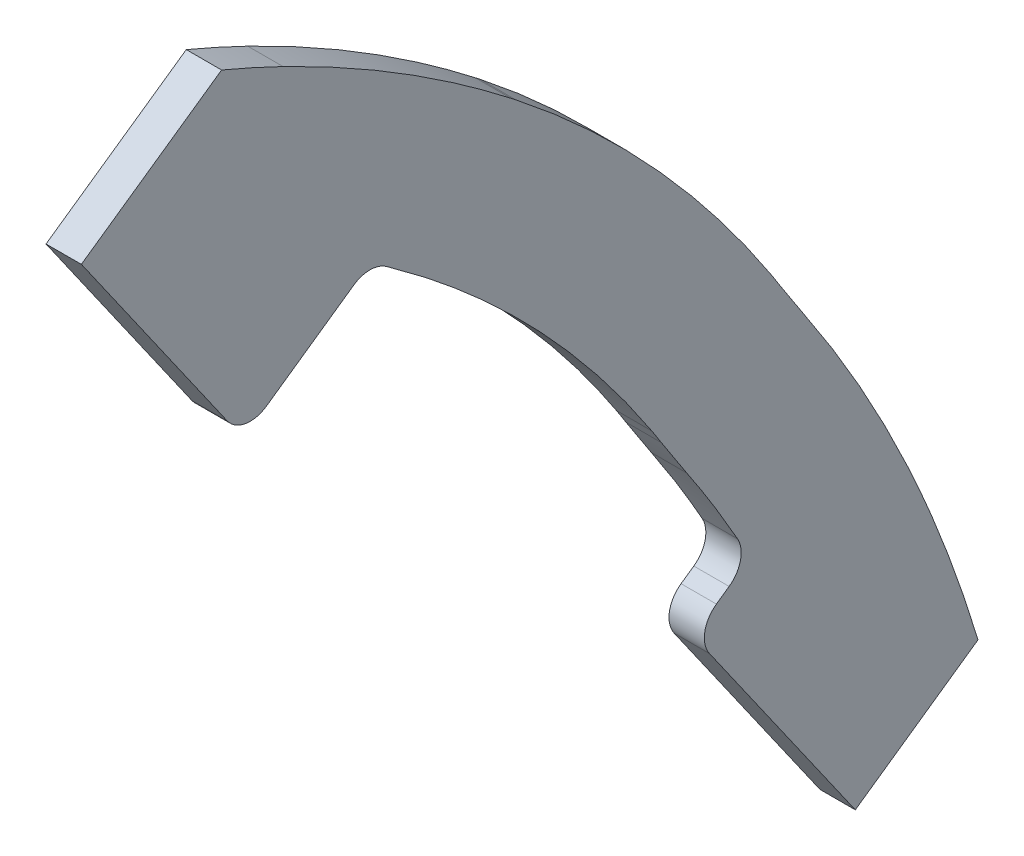
ISO-10303-21;
HEADER;
FILE_DESCRIPTION(('STEP AP214'),'2;1');
FILE_NAME('part.step','',(''),(''),'','','');
FILE_SCHEMA(('AUTOMOTIVE_DESIGN { 1 0 10303 214 1 1 1 1 }'));
ENDSEC;
DATA;
#1=APPLICATION_CONTEXT('core data for automotive mechanical design processes');
#2=APPLICATION_PROTOCOL_DEFINITION('international standard','automotive_design',2000,#1);
#3=PRODUCT_CONTEXT('',#1,'mechanical');
#4=PRODUCT('Part','Part','',(#3));
#5=PRODUCT_RELATED_PRODUCT_CATEGORY('part','',(#4));
#6=PRODUCT_DEFINITION_FORMATION('','',#4);
#7=PRODUCT_DEFINITION_CONTEXT('part definition',#1,'design');
#8=PRODUCT_DEFINITION('design','',#6,#7);
#9=PRODUCT_DEFINITION_SHAPE('','',#8);
#10=(LENGTH_UNIT() NAMED_UNIT(*) SI_UNIT(.MILLI.,.METRE.));
#11=(NAMED_UNIT(*) PLANE_ANGLE_UNIT() SI_UNIT($,.RADIAN.));
#12=(NAMED_UNIT(*) SI_UNIT($,.STERADIAN.) SOLID_ANGLE_UNIT());
#13=UNCERTAINTY_MEASURE_WITH_UNIT(LENGTH_MEASURE(1.E-05),#10,'distance_accuracy_value','');
#14=(GEOMETRIC_REPRESENTATION_CONTEXT(3) GLOBAL_UNCERTAINTY_ASSIGNED_CONTEXT((#13)) GLOBAL_UNIT_ASSIGNED_CONTEXT((#10,
#11,#12)) REPRESENTATION_CONTEXT('',''));
#15=CARTESIAN_POINT('',(0.,0.,0.));
#16=DIRECTION('',(0.,0.,1.));
#17=DIRECTION('',(1.,0.,0.));
#18=AXIS2_PLACEMENT_3D('',#15,#16,#17);
#19=CARTESIAN_POINT('',(-1.5875,88.7800683087997,-96.776788330437));
#20=CARTESIAN_POINT('',(-1.5875,95.4836120909318,-94.0088629009082));
#21=CARTESIAN_POINT('',(-1.5875,101.901927907169,-90.5708956129696));
#22=CARTESIAN_POINT('',(-1.5875,107.915935135417,-86.5173656866349));
#23=B_SPLINE_CURVE_WITH_KNOTS('',3,(#19,#20,#21,#22),.UNSPECIFIED.,.F.,.F.,(4,4),(0.,1.),.UNSPECIFIED.);
#24=DIRECTION('',(1.,0.,0.));
#25=VECTOR('',#24,1.);
#26=SURFACE_OF_LINEAR_EXTRUSION('',#23,#25);
#27=CARTESIAN_POINT('',(-1.5875,107.915935135417,-86.5173656866349));
#28=CARTESIAN_POINT('',(-1.5875,105.504266930419,-88.1428657684157));
#29=CARTESIAN_POINT('',(-1.5875,103.027582733859,-89.6693785506604));
#30=CARTESIAN_POINT('',(-1.5875,100.493561497346,-91.0933909236212));
#31=B_SPLINE_CURVE_WITH_KNOTS('',3,(#27,#28,#29,#30),.UNSPECIFIED.,.F.,.F.,(4,4),
(0.598991468837967,1.),.UNSPECIFIED.);
#32=CARTESIAN_POINT('',(-1.5875,100.493573316672,-91.0934119560397));
#33=VERTEX_POINT('',#32);
#34=CARTESIAN_POINT('',(-1.5875,107.915935135417,-86.5173656866349));
#35=VERTEX_POINT('',#34);
#36=EDGE_CURVE('E383',#33,#35,#31,.F.);
#37=ORIENTED_EDGE('',*,*,#36,.F.);
#38=DIRECTION('',(1.,0.,0.));
#39=VECTOR('',#38,1.);
#40=CARTESIAN_POINT('',(-1.5875,100.49356149863,-91.0933909228994));
#41=LINE('',#40,#39);
#42=CARTESIAN_POINT('',(1.5875,100.493573316672,-91.0934119560397));
#43=VERTEX_POINT('',#42);
#44=EDGE_CURVE('E63',#33,#43,#41,.T.);
#45=ORIENTED_EDGE('',*,*,#44,.T.);
#46=CARTESIAN_POINT('',(1.5875,100.493561497988,-91.0933909232603));
#47=CARTESIAN_POINT('',(1.5875,103.027582734277,-89.6693785504025));
#48=CARTESIAN_POINT('',(1.5875,105.504266930623,-88.1428657682784));
#49=CARTESIAN_POINT('',(1.5875,107.915935135417,-86.5173656866349));
#50=B_SPLINE_CURVE_WITH_KNOTS('',3,(#46,#47,#48,#49),.UNSPECIFIED.,.F.,.F.,(4,4),
(0.59899146887184,1.),.UNSPECIFIED.);
#51=CARTESIAN_POINT('',(1.5875,107.915935135417,-86.5173656866349));
#52=VERTEX_POINT('',#51);
#53=EDGE_CURVE('E285',#43,#52,#50,.T.);
#54=ORIENTED_EDGE('',*,*,#53,.T.);
#55=DIRECTION('',(1.,0.,0.));
#56=VECTOR('',#55,1.);
#57=CARTESIAN_POINT('',(-1.5875,107.915935135417,-86.5173656866349));
#58=LINE('',#57,#56);
#59=EDGE_CURVE('E566',#35,#52,#58,.T.);
#60=ORIENTED_EDGE('',*,*,#59,.F.);
#61=EDGE_LOOP('',(#37,#45,#54,#60));
#62=FACE_BOUND('',#61,.T.);
#63=ADVANCED_FACE('F41',(#62),#26,.F.);
#64=CARTESIAN_POINT('',(1.5875,93.6270317100952,-108.515482712118));
#65=CARTESIAN_POINT('',(1.5875,88.0312485824802,-110.826008494565));
#66=CARTESIAN_POINT('',(1.5875,82.2656921555576,-112.729048559774));
#67=CARTESIAN_POINT('',(1.5875,76.3893372673394,-114.202129114204));
#68=(BOUNDED_CURVE() B_SPLINE_CURVE(3,(#64,#65,#66,#67),.UNSPECIFIED.,.F.,
.F.) B_SPLINE_CURVE_WITH_KNOTS((4,4),(0.,1.),
.UNSPECIFIED.) CURVE() GEOMETRIC_REPRESENTATION_ITEM() RATIONAL_B_SPLINE_CURVE((1.,1.,1.,1.)) REPRESENTATION_ITEM(''));
#69=DIRECTION('',(-1.,0.,0.));
#70=VECTOR('',#69,1.);
#71=SURFACE_OF_LINEAR_EXTRUSION('',#68,#70);
#72=CARTESIAN_POINT('',(1.5875,93.6270317100952,-108.515482712118));
#73=VERTEX_POINT('',#72);
#74=CARTESIAN_POINT('',(1.5875,81.825546879037,-112.707408993809));
#75=VERTEX_POINT('',#74);
#76=EDGE_CURVE('E223',#73,#75,#68,.T.);
#77=ORIENTED_EDGE('',*,*,#76,.T.);
#78=DIRECTION('',(1.,0.,0.));
#79=VECTOR('',#78,1.);
#80=CARTESIAN_POINT('',(-2.2225,81.825546879037,-112.707408993809));
#81=LINE('',#80,#79);
#82=CARTESIAN_POINT('',(-1.5875,81.825546879037,-112.707408993809));
#83=VERTEX_POINT('',#82);
#84=EDGE_CURVE('E206',#83,#75,#81,.T.);
#85=ORIENTED_EDGE('',*,*,#84,.F.);
#86=CARTESIAN_POINT('',(-1.5875,93.6270317100952,-108.515482712118));
#87=CARTESIAN_POINT('',(-1.5875,88.0312485824802,-110.826008494565));
#88=CARTESIAN_POINT('',(-1.5875,82.2656921555576,-112.729048559774));
#89=CARTESIAN_POINT('',(-1.5875,76.3893372673394,-114.202129114204));
#90=(BOUNDED_CURVE() B_SPLINE_CURVE(3,(#86,#87,#88,#89),.UNSPECIFIED.,.F.,
.F.) B_SPLINE_CURVE_WITH_KNOTS((4,4),(0.,1.),
.UNSPECIFIED.) CURVE() GEOMETRIC_REPRESENTATION_ITEM() RATIONAL_B_SPLINE_CURVE((1.,1.,1.,1.)) REPRESENTATION_ITEM(''));
#91=CARTESIAN_POINT('',(-1.5875,93.6270317100952,-108.515482712118));
#92=VERTEX_POINT('',#91);
#93=EDGE_CURVE('E774',#92,#83,#90,.T.);
#94=ORIENTED_EDGE('',*,*,#93,.F.);
#95=DIRECTION('',(-1.,0.,0.));
#96=VECTOR('',#95,1.);
#97=CARTESIAN_POINT('',(1.5875,93.6270317100952,-108.515482712118));
#98=LINE('',#97,#96);
#99=EDGE_CURVE('E392',#73,#92,#98,.T.);
#100=ORIENTED_EDGE('',*,*,#99,.F.);
#101=EDGE_LOOP('',(#77,#85,#94,#100));
#102=FACE_BOUND('',#101,.T.);
#103=ADVANCED_FACE('F309',(#102),#71,.T.);
#104=CARTESIAN_POINT('',(1.5875,169.18994581688,8.75182569076107E-09));
#105=CARTESIAN_POINT('',(1.5875,169.189794661323,-13.0067356295379));
#106=CARTESIAN_POINT('',(1.5875,167.235783234296,-26.0150387116111));
#107=CARTESIAN_POINT('',(1.5875,163.333674627763,-38.5625912605726));
#108=CARTESIAN_POINT('',(1.5875,157.690613368795,-50.2374657150393));
#109=(BOUNDED_CURVE() B_SPLINE_CURVE(4,(#104,#105,#106,#107,#108),.UNSPECIFIED.,.F.,
.F.) B_SPLINE_CURVE_WITH_KNOTS((5,5),(0.,1.),
.UNSPECIFIED.) CURVE() GEOMETRIC_REPRESENTATION_ITEM() RATIONAL_B_SPLINE_CURVE((1.,1.,1.,1.,1.)) REPRESENTATION_ITEM(''));
#110=DIRECTION('',(-1.,0.,0.));
#111=VECTOR('',#110,1.);
#112=SURFACE_OF_LINEAR_EXTRUSION('',#109,#111);
#113=DIRECTION('',(1.,0.,0.));
#114=VECTOR('',#113,1.);
#115=CARTESIAN_POINT('',(-2.2225,160.183857740543,-44.7127582391958));
#116=LINE('',#115,#114);
#117=CARTESIAN_POINT('',(-1.5875,160.183857740543,-44.7127582391958));
#118=VERTEX_POINT('',#117);
#119=CARTESIAN_POINT('',(1.5875,160.183857740543,-44.7127582391958));
#120=VERTEX_POINT('',#119);
#121=EDGE_CURVE('E222',#118,#120,#116,.T.);
#122=ORIENTED_EDGE('',*,*,#121,.T.);
#123=CARTESIAN_POINT('',(1.5875,157.690613368795,-50.2374657150393));
#124=VERTEX_POINT('',#123);
#125=EDGE_CURVE('E352',#120,#124,#109,.T.);
#126=ORIENTED_EDGE('',*,*,#125,.T.);
#127=DIRECTION('',(-1.,0.,0.));
#128=VECTOR('',#127,1.);
#129=CARTESIAN_POINT('',(1.5875,157.690613368795,-50.2374657150393));
#130=LINE('',#129,#128);
#131=CARTESIAN_POINT('',(-1.5875,157.690613368795,-50.2374657150393));
#132=VERTEX_POINT('',#131);
#133=EDGE_CURVE('E741',#124,#132,#130,.T.);
#134=ORIENTED_EDGE('',*,*,#133,.T.);
#135=CARTESIAN_POINT('',(-1.5875,169.18994581688,8.75182569076107E-09));
#136=CARTESIAN_POINT('',(-1.5875,169.189794661323,-13.0067356295379));
#137=CARTESIAN_POINT('',(-1.5875,167.235783234296,-26.0150387116111));
#138=CARTESIAN_POINT('',(-1.5875,163.333674627763,-38.5625912605726));
#139=CARTESIAN_POINT('',(-1.5875,157.690613368795,-50.2374657150393));
#140=(BOUNDED_CURVE() B_SPLINE_CURVE(4,(#135,#136,#137,#138,#139),.UNSPECIFIED.,.F.,
.F.) B_SPLINE_CURVE_WITH_KNOTS((5,5),(0.,1.),
.UNSPECIFIED.) CURVE() GEOMETRIC_REPRESENTATION_ITEM() RATIONAL_B_SPLINE_CURVE((1.,1.,1.,1.,1.)) REPRESENTATION_ITEM(''));
#141=EDGE_CURVE('E733',#118,#132,#140,.T.);
#142=ORIENTED_EDGE('',*,*,#141,.F.);
#143=EDGE_LOOP('',(#122,#126,#134,#142));
#144=FACE_BOUND('',#143,.T.);
#145=ADVANCED_FACE('F668',(#144),#112,.T.);
#146=CARTESIAN_POINT('',(1.5875,115.014111075737,-97.0485526244998));
#147=CARTESIAN_POINT('',(1.5875,108.292402496115,-101.579083741193));
#148=CARTESIAN_POINT('',(1.5875,101.116024349716,-105.423241676263));
#149=CARTESIAN_POINT('',(1.5875,93.627031710095,-108.515482712118));
#150=(BOUNDED_CURVE() B_SPLINE_CURVE(3,(#146,#147,#148,#149),.UNSPECIFIED.,.F.,
.F.) B_SPLINE_CURVE_WITH_KNOTS((4,4),(0.,1.),
.UNSPECIFIED.) CURVE() GEOMETRIC_REPRESENTATION_ITEM() RATIONAL_B_SPLINE_CURVE((1.,1.,1.,1.)) REPRESENTATION_ITEM(''));
#151=DIRECTION('',(-1.,0.,0.));
#152=VECTOR('',#151,1.);
#153=SURFACE_OF_LINEAR_EXTRUSION('',#150,#152);
#154=CARTESIAN_POINT('',(-1.5875,115.014111075737,-97.0485526244998));
#155=CARTESIAN_POINT('',(-1.5875,108.292402496115,-101.579083741193));
#156=CARTESIAN_POINT('',(-1.5875,101.116024349716,-105.423241676263));
#157=CARTESIAN_POINT('',(-1.5875,93.627031710095,-108.515482712118));
#158=(BOUNDED_CURVE() B_SPLINE_CURVE(3,(#154,#155,#156,#157),.UNSPECIFIED.,.F.,
.F.) B_SPLINE_CURVE_WITH_KNOTS((4,4),(0.,1.),
.UNSPECIFIED.) CURVE() GEOMETRIC_REPRESENTATION_ITEM() RATIONAL_B_SPLINE_CURVE((1.,1.,1.,1.)) REPRESENTATION_ITEM(''));
#159=CARTESIAN_POINT('',(-1.5875,115.014111075737,-97.0485526244998));
#160=VERTEX_POINT('',#159);
#161=EDGE_CURVE('E766',#160,#92,#158,.T.);
#162=ORIENTED_EDGE('',*,*,#161,.F.);
#163=DIRECTION('',(-1.,0.,0.));
#164=VECTOR('',#163,1.);
#165=CARTESIAN_POINT('',(1.5875,115.014111075737,-97.0485526244998));
#166=LINE('',#165,#164);
#167=CARTESIAN_POINT('',(1.5875,115.014111075737,-97.0485526244998));
#168=VERTEX_POINT('',#167);
#169=EDGE_CURVE('E687',#168,#160,#166,.T.);
#170=ORIENTED_EDGE('',*,*,#169,.F.);
#171=EDGE_CURVE('E651',#168,#73,#150,.T.);
#172=ORIENTED_EDGE('',*,*,#171,.T.);
#173=ORIENTED_EDGE('',*,*,#99,.T.);
#174=EDGE_LOOP('',(#162,#170,#172,#173));
#175=FACE_BOUND('',#174,.T.);
#176=ADVANCED_FACE('F671',(#175),#153,.T.);
#177=CARTESIAN_POINT('',(1.5875,118.178380489188,-94.9883093202764));
#178=CARTESIAN_POINT('',(1.5875,117.116005214424,-95.6560781713369));
#179=CARTESIAN_POINT('',(1.5875,116.060431913397,-96.3433169268644));
#180=CARTESIAN_POINT('',(1.5875,115.014111075737,-97.0485526244998));
#181=(BOUNDED_CURVE() B_SPLINE_CURVE(3,(#177,#178,#179,#180),.UNSPECIFIED.,.F.,
.F.) B_SPLINE_CURVE_WITH_KNOTS((4,4),(0.,1.),
.UNSPECIFIED.) CURVE() GEOMETRIC_REPRESENTATION_ITEM() RATIONAL_B_SPLINE_CURVE((1.,1.,1.,1.)) REPRESENTATION_ITEM(''));
#182=DIRECTION('',(-1.,0.,0.));
#183=VECTOR('',#182,1.);
#184=SURFACE_OF_LINEAR_EXTRUSION('',#181,#183);
#185=CARTESIAN_POINT('',(-1.5875,118.178380489188,-94.9883093202764));
#186=CARTESIAN_POINT('',(-1.5875,117.116005214424,-95.6560781713369));
#187=CARTESIAN_POINT('',(-1.5875,116.060431913397,-96.3433169268644));
#188=CARTESIAN_POINT('',(-1.5875,115.014111075737,-97.0485526244998));
#189=(BOUNDED_CURVE() B_SPLINE_CURVE(3,(#185,#186,#187,#188),.UNSPECIFIED.,.F.,
.F.) B_SPLINE_CURVE_WITH_KNOTS((4,4),(0.,1.),
.UNSPECIFIED.) CURVE() GEOMETRIC_REPRESENTATION_ITEM() RATIONAL_B_SPLINE_CURVE((1.,1.,1.,1.)) REPRESENTATION_ITEM(''));
#190=CARTESIAN_POINT('',(-1.5875,118.178380489188,-94.9883093202763));
#191=VERTEX_POINT('',#190);
#192=EDGE_CURVE('E761',#191,#160,#189,.T.);
#193=ORIENTED_EDGE('',*,*,#192,.F.);
#194=DIRECTION('',(-1.,0.,0.));
#195=VECTOR('',#194,1.);
#196=CARTESIAN_POINT('',(1.5875,118.178380489188,-94.9883093202763));
#197=LINE('',#196,#195);
#198=CARTESIAN_POINT('',(1.5875,118.178380489188,-94.9883093202763));
#199=VERTEX_POINT('',#198);
#200=EDGE_CURVE('E694',#199,#191,#197,.T.);
#201=ORIENTED_EDGE('',*,*,#200,.F.);
#202=EDGE_CURVE('E681',#199,#168,#181,.T.);
#203=ORIENTED_EDGE('',*,*,#202,.T.);
#204=ORIENTED_EDGE('',*,*,#169,.T.);
#205=EDGE_LOOP('',(#193,#201,#203,#204));
#206=FACE_BOUND('',#205,.T.);
#207=ADVANCED_FACE('F674',(#206),#184,.T.);
#208=CARTESIAN_POINT('',(1.5875,63.3548181596361,-7.75744346018917));
#209=DIRECTION('',(-1.,0.,0.));
#210=DIRECTION('',(0.,0.,1.));
#211=AXIS2_PLACEMENT_3D('',#208,#209,#210);
#212=CYLINDRICAL_SURFACE('',#211,103.0283793195);
#213=CARTESIAN_POINT('',(-1.5875,63.3548181596361,-7.75744346018917));
#214=DIRECTION('',(1.,0.,0.));
#215=DIRECTION('',(0.,0.,-1.));
#216=AXIS2_PLACEMENT_3D('',#213,#214,#215);
#217=CIRCLE('',#216,103.0283793195);
#218=CARTESIAN_POINT('',(-1.5875,119.697960171294,-94.0146013861083));
#219=VERTEX_POINT('',#218);
#220=EDGE_CURVE('E755',#219,#191,#217,.F.);
#221=ORIENTED_EDGE('',*,*,#220,.F.);
#222=DIRECTION('',(-1.,0.,0.));
#223=VECTOR('',#222,1.);
#224=CARTESIAN_POINT('',(1.5875,119.697960171294,-94.0146013861083));
#225=LINE('',#224,#223);
#226=CARTESIAN_POINT('',(1.5875,119.697960171294,-94.0146013861083));
#227=VERTEX_POINT('',#226);
#228=EDGE_CURVE('E701',#227,#219,#225,.T.);
#229=ORIENTED_EDGE('',*,*,#228,.F.);
#230=CARTESIAN_POINT('',(1.5875,63.3548181596361,-7.75744346018917));
#231=DIRECTION('',(1.,0.,0.));
#232=DIRECTION('',(0.,0.,-1.));
#233=AXIS2_PLACEMENT_3D('',#230,#231,#232);
#234=CIRCLE('',#233,103.0283793195);
#235=EDGE_CURVE('E688',#227,#199,#234,.F.);
#236=ORIENTED_EDGE('',*,*,#235,.T.);
#237=ORIENTED_EDGE('',*,*,#200,.T.);
#238=EDGE_LOOP('',(#221,#229,#236,#237));
#239=FACE_BOUND('',#238,.T.);
#240=ADVANCED_FACE('F678',(#239),#212,.T.);
#241=CARTESIAN_POINT('',(1.5875,144.635475433697,-71.1611432299567));
#242=CARTESIAN_POINT('',(1.5875,137.608784490994,-80.1065976384552));
#243=CARTESIAN_POINT('',(1.5875,129.14774479477,-87.841288267326));
#244=CARTESIAN_POINT('',(1.5875,119.697960171294,-94.0146013861083));
#245=(BOUNDED_CURVE() B_SPLINE_CURVE(3,(#241,#242,#243,#244),.UNSPECIFIED.,.F.,
.F.) B_SPLINE_CURVE_WITH_KNOTS((4,4),(0.,1.),
.UNSPECIFIED.) CURVE() GEOMETRIC_REPRESENTATION_ITEM() RATIONAL_B_SPLINE_CURVE((1.,1.,1.,1.)) REPRESENTATION_ITEM(''));
#246=DIRECTION('',(-1.,0.,0.));
#247=VECTOR('',#246,1.);
#248=SURFACE_OF_LINEAR_EXTRUSION('',#245,#247);
#249=CARTESIAN_POINT('',(-1.5875,144.635475433697,-71.1611432299567));
#250=CARTESIAN_POINT('',(-1.5875,137.608784490994,-80.1065976384552));
#251=CARTESIAN_POINT('',(-1.5875,129.14774479477,-87.841288267326));
#252=CARTESIAN_POINT('',(-1.5875,119.697960171294,-94.0146013861083));
#253=(BOUNDED_CURVE() B_SPLINE_CURVE(3,(#249,#250,#251,#252),.UNSPECIFIED.,.F.,
.F.) B_SPLINE_CURVE_WITH_KNOTS((4,4),(0.,1.),
.UNSPECIFIED.) CURVE() GEOMETRIC_REPRESENTATION_ITEM() RATIONAL_B_SPLINE_CURVE((1.,1.,1.,1.)) REPRESENTATION_ITEM(''));
#254=CARTESIAN_POINT('',(-1.5875,144.635475433697,-71.1611432299567));
#255=VERTEX_POINT('',#254);
#256=EDGE_CURVE('E728',#255,#219,#253,.T.);
#257=ORIENTED_EDGE('',*,*,#256,.F.);
#258=DIRECTION('',(-1.,0.,0.));
#259=VECTOR('',#258,1.);
#260=CARTESIAN_POINT('',(1.5875,144.635475433697,-71.1611432299567));
#261=LINE('',#260,#259);
#262=CARTESIAN_POINT('',(1.5875,144.635475433697,-71.1611432299567));
#263=VERTEX_POINT('',#262);
#264=EDGE_CURVE('E725',#263,#255,#261,.T.);
#265=ORIENTED_EDGE('',*,*,#264,.F.);
#266=EDGE_CURVE('E695',#263,#227,#245,.T.);
#267=ORIENTED_EDGE('',*,*,#266,.T.);
#268=ORIENTED_EDGE('',*,*,#228,.T.);
#269=EDGE_LOOP('',(#257,#265,#267,#268));
#270=FACE_BOUND('',#269,.T.);
#271=ADVANCED_FACE('F709',(#270),#248,.T.);
#272=CARTESIAN_POINT('',(1.5875,144.994599704752,-70.7017822344691));
#273=CARTESIAN_POINT('',(1.5875,144.875309775761,-70.8552412666994));
#274=CARTESIAN_POINT('',(1.5875,144.755529232783,-71.0083060491197));
#275=CARTESIAN_POINT('',(1.5875,144.635475433697,-71.1611432299567));
#276=(BOUNDED_CURVE() B_SPLINE_CURVE(3,(#272,#273,#274,#275),.UNSPECIFIED.,.F.,
.F.) B_SPLINE_CURVE_WITH_KNOTS((4,4),(0.,1.),
.UNSPECIFIED.) CURVE() GEOMETRIC_REPRESENTATION_ITEM() RATIONAL_B_SPLINE_CURVE((1.,1.,1.,1.)) REPRESENTATION_ITEM(''));
#277=DIRECTION('',(-1.,0.,0.));
#278=VECTOR('',#277,1.);
#279=SURFACE_OF_LINEAR_EXTRUSION('',#276,#278);
#280=CARTESIAN_POINT('',(-1.5875,144.994599704752,-70.7017822344691));
#281=CARTESIAN_POINT('',(-1.5875,144.875309775761,-70.8552412666994));
#282=CARTESIAN_POINT('',(-1.5875,144.755529232783,-71.0083060491197));
#283=CARTESIAN_POINT('',(-1.5875,144.635475433697,-71.1611432299567));
#284=(BOUNDED_CURVE() B_SPLINE_CURVE(3,(#280,#281,#282,#283),.UNSPECIFIED.,.F.,
.F.) B_SPLINE_CURVE_WITH_KNOTS((4,4),(0.,1.),
.UNSPECIFIED.) CURVE() GEOMETRIC_REPRESENTATION_ITEM() RATIONAL_B_SPLINE_CURVE((1.,1.,1.,1.)) REPRESENTATION_ITEM(''));
#285=CARTESIAN_POINT('',(-1.5875,144.994599704752,-70.7017822344691));
#286=VERTEX_POINT('',#285);
#287=EDGE_CURVE('E721',#286,#255,#284,.T.);
#288=ORIENTED_EDGE('',*,*,#287,.F.);
#289=DIRECTION('',(-1.,0.,0.));
#290=VECTOR('',#289,1.);
#291=CARTESIAN_POINT('',(1.5875,144.994599704752,-70.7017822344691));
#292=LINE('',#291,#290);
#293=CARTESIAN_POINT('',(1.5875,144.994599704752,-70.7017822344691));
#294=VERTEX_POINT('',#293);
#295=EDGE_CURVE('E212',#294,#286,#292,.T.);
#296=ORIENTED_EDGE('',*,*,#295,.F.);
#297=EDGE_CURVE('E702',#294,#263,#276,.T.);
#298=ORIENTED_EDGE('',*,*,#297,.T.);
#299=ORIENTED_EDGE('',*,*,#264,.T.);
#300=EDGE_LOOP('',(#288,#296,#298,#299));
#301=FACE_BOUND('',#300,.T.);
#302=ADVANCED_FACE('F711',(#301),#279,.T.);
#303=CARTESIAN_POINT('',(1.5875,157.690613368795,-50.2374657150393));
#304=CARTESIAN_POINT('',(1.5875,154.185304199465,-57.4895836956331));
#305=CARTESIAN_POINT('',(1.5875,149.921691806846,-64.3634008386052));
#306=CARTESIAN_POINT('',(1.5875,144.994599704752,-70.7017822344691));
#307=(BOUNDED_CURVE() B_SPLINE_CURVE(3,(#303,#304,#305,#306),.UNSPECIFIED.,.F.,
.F.) B_SPLINE_CURVE_WITH_KNOTS((4,4),(0.,1.),
.UNSPECIFIED.) CURVE() GEOMETRIC_REPRESENTATION_ITEM() RATIONAL_B_SPLINE_CURVE((1.,1.,1.,1.)) REPRESENTATION_ITEM(''));
#308=DIRECTION('',(-1.,0.,0.));
#309=VECTOR('',#308,1.);
#310=SURFACE_OF_LINEAR_EXTRUSION('',#307,#309);
#311=CARTESIAN_POINT('',(-1.5875,157.690613368795,-50.2374657150393));
#312=CARTESIAN_POINT('',(-1.5875,154.185304199465,-57.4895836956331));
#313=CARTESIAN_POINT('',(-1.5875,149.921691806846,-64.3634008386052));
#314=CARTESIAN_POINT('',(-1.5875,144.994599704752,-70.7017822344691));
#315=(BOUNDED_CURVE() B_SPLINE_CURVE(3,(#311,#312,#313,#314),.UNSPECIFIED.,.F.,
.F.) B_SPLINE_CURVE_WITH_KNOTS((4,4),(0.,1.),
.UNSPECIFIED.) CURVE() GEOMETRIC_REPRESENTATION_ITEM() RATIONAL_B_SPLINE_CURVE((1.,1.,1.,1.)) REPRESENTATION_ITEM(''));
#316=EDGE_CURVE('E729',#132,#286,#315,.T.);
#317=ORIENTED_EDGE('',*,*,#316,.F.);
#318=ORIENTED_EDGE('',*,*,#133,.F.);
#319=EDGE_CURVE('E785',#124,#294,#307,.T.);
#320=ORIENTED_EDGE('',*,*,#319,.T.);
#321=ORIENTED_EDGE('',*,*,#295,.T.);
#322=EDGE_LOOP('',(#317,#318,#320,#321));
#323=FACE_BOUND('',#322,.T.);
#324=ADVANCED_FACE('F402',(#323),#310,.T.);
#325=CARTESIAN_POINT('',(1.5875,0.,0.));
#326=DIRECTION('',(1.,0.,0.));
#327=DIRECTION('',(0.,0.,-1.));
#328=AXIS2_PLACEMENT_3D('',#325,#326,#327);
#329=PLANE('',#328);
#330=DIRECTION('',(0.,0.573576436351042,-0.819152044288995));
#331=VECTOR('',#330,1.);
#332=CARTESIAN_POINT('',(1.5875,22.7570677304037,15.9346703723774));
#333=LINE('',#332,#331);
#334=CARTESIAN_POINT('',(1.5875,96.3667462815078,-89.190845327311));
#335=VERTEX_POINT('',#334);
#336=CARTESIAN_POINT('',(1.5875,97.1685643085926,-90.3359601444621));
#337=VERTEX_POINT('',#336);
#338=EDGE_CURVE('E228',#335,#337,#333,.T.);
#339=ORIENTED_EDGE('',*,*,#338,.F.);
#340=CARTESIAN_POINT('',(1.5875,94.2861000890138,-90.6477294756426));
#341=DIRECTION('',(1.,0.,0.));
#342=DIRECTION('',(0.,0.,-1.));
#343=AXIS2_PLACEMENT_3D('',#340,#341,#342);
#344=CIRCLE('',#343,2.54);
#345=CARTESIAN_POINT('',(1.5875,92.8292159406821,-88.5670832831486));
#346=VERTEX_POINT('',#345);
#347=EDGE_CURVE('E227',#335,#346,#344,.T.);
#348=ORIENTED_EDGE('',*,*,#347,.T.);
#349=DIRECTION('',(0.,0.819152044288995,0.573576436351041));
#350=VECTOR('',#349,1.);
#351=CARTESIAN_POINT('',(1.5875,72.1527944027725,-103.044869507194));
#352=LINE('',#351,#350);
#353=CARTESIAN_POINT('',(1.5875,74.1034002082357,-101.679040618133));
#354=VERTEX_POINT('',#353);
#355=EDGE_CURVE('E218',#354,#346,#352,.T.);
#356=ORIENTED_EDGE('',*,*,#355,.F.);
#357=DIRECTION('',(0.,0.573576436351042,-0.819152044288995));
#358=VECTOR('',#357,1.);
#359=CARTESIAN_POINT('',(1.5875,1.95060580546317,1.36582888906092));
#360=LINE('',#359,#358);
#361=EDGE_CURVE('E200',#354,#75,#360,.T.);
#362=ORIENTED_EDGE('',*,*,#361,.T.);
#363=ORIENTED_EDGE('',*,*,#76,.F.);
#364=ORIENTED_EDGE('',*,*,#171,.F.);
#365=ORIENTED_EDGE('',*,*,#202,.F.);
#366=ORIENTED_EDGE('',*,*,#235,.F.);
#367=ORIENTED_EDGE('',*,*,#266,.F.);
#368=ORIENTED_EDGE('',*,*,#297,.F.);
#369=ORIENTED_EDGE('',*,*,#319,.F.);
#370=ORIENTED_EDGE('',*,*,#125,.F.);
#371=DIRECTION('',(0.,0.573576436351042,-0.819152044288995));
#372=VECTOR('',#371,1.);
#373=CARTESIAN_POINT('',(1.5875,86.4768573755338,60.551747415034));
#374=LINE('',#373,#372);
#375=CARTESIAN_POINT('',(1.5875,151.359113870986,-32.109744919961));
#376=VERTEX_POINT('',#375);
#377=EDGE_CURVE('E339',#376,#120,#374,.T.);
#378=ORIENTED_EDGE('',*,*,#377,.F.);
#379=DIRECTION('',(0.,-0.819152044288995,-0.573576436351042));
#380=VECTOR('',#379,1.);
#381=CARTESIAN_POINT('',(1.5875,64.8737972727763,-92.6493842649085));
#382=LINE('',#381,#380);
#383=CARTESIAN_POINT('',(1.5875,132.624838915863,-45.2095941848599));
#384=VERTEX_POINT('',#383);
#385=EDGE_CURVE('E252',#376,#384,#382,.T.);
#386=ORIENTED_EDGE('',*,*,#385,.T.);
#387=CARTESIAN_POINT('',(1.5875,134.081723064194,-47.290240377354));
#388=DIRECTION('',(1.,0.,0.));
#389=DIRECTION('',(0.,0.,-1.));
#390=AXIS2_PLACEMENT_3D('',#387,#388,#389);
#391=CIRCLE('',#390,2.54);
#392=CARTESIAN_POINT('',(1.5875,132.0010768717,-48.7471245256856));
#393=VERTEX_POINT('',#392);
#394=EDGE_CURVE('E360',#384,#393,#391,.T.);
#395=ORIENTED_EDGE('',*,*,#394,.T.);
#396=DIRECTION('',(0.,0.573576436351042,-0.819152044288995));
#397=VECTOR('',#396,1.);
#398=CARTESIAN_POINT('',(1.5875,65.6703954505924,45.9829059317169));
#399=LINE('',#398,#397);
#400=CARTESIAN_POINT('',(1.5875,137.496605686943,-56.5955530491685));
#401=VERTEX_POINT('',#400);
#402=EDGE_CURVE('E355',#393,#401,#399,.T.);
#403=ORIENTED_EDGE('',*,*,#402,.T.);
#404=CARTESIAN_POINT('',(1.5875,135.415959494449,-58.0524371975002));
#405=DIRECTION('',(1.,0.,0.));
#406=DIRECTION('',(0.,0.,-1.));
#407=AXIS2_PLACEMENT_3D('',#404,#405,#406);
#408=CIRCLE('',#407,2.54);
#409=CARTESIAN_POINT('',(1.5875,137.484615318078,-59.5263862965671));
#410=VERTEX_POINT('',#409);
#411=EDGE_CURVE('E273',#401,#410,#408,.F.);
#412=ORIENTED_EDGE('',*,*,#411,.T.);
#413=CARTESIAN_POINT('',(1.5875,134.967710945653,-62.9074572596774));
#414=CARTESIAN_POINT('',(1.5875,135.830235138975,-61.7978763573623));
#415=CARTESIAN_POINT('',(1.5875,136.669349898596,-60.6705045895705));
#416=CARTESIAN_POINT('',(1.5875,137.484573177318,-59.5263562695828));
#417=B_SPLINE_CURVE_WITH_KNOTS('',3,(#413,#414,#415,#416),.UNSPECIFIED.,.F.,.F.,(4,4),(0.,
0.196444717254091),.UNSPECIFIED.);
#418=CARTESIAN_POINT('',(1.5875,134.967710945647,-62.9074572596726));
#419=VERTEX_POINT('',#418);
#420=EDGE_CURVE('E501',#419,#410,#417,.T.);
#421=ORIENTED_EDGE('',*,*,#420,.F.);
#422=CARTESIAN_POINT('',(1.5875,134.648199076322,-63.3161250042664));
#423=CARTESIAN_POINT('',(1.5875,134.75501205039,-63.180144352611));
#424=CARTESIAN_POINT('',(1.5875,134.861588357498,-63.0439773315083));
#425=CARTESIAN_POINT('',(1.5875,134.967710945647,-62.9074572596726));
#426=B_SPLINE_CURVE_WITH_KNOTS('',3,(#422,#423,#424,#425),.UNSPECIFIED.,.F.,.F.,(4,4),(0.,
0.000518746317082111),.UNSPECIFIED.);
#427=CARTESIAN_POINT('',(1.5875,134.648199076306,-63.3161250042509));
#428=VERTEX_POINT('',#427);
#429=EDGE_CURVE('E496',#428,#419,#426,.T.);
#430=ORIENTED_EDGE('',*,*,#429,.F.);
#431=CARTESIAN_POINT('',(1.5875,112.752426785362,-83.3821244350343));
#432=CARTESIAN_POINT('',(1.5875,114.835699872509,-82.0211620182452));
#433=CARTESIAN_POINT('',(1.5875,116.858559435371,-80.5776358145142));
#434=CARTESIAN_POINT('',(1.5875,120.784865733729,-77.5273885702384));
#435=CARTESIAN_POINT('',(1.5875,122.687392880695,-75.9209127372153));
#436=CARTESIAN_POINT('',(1.5875,126.351023386742,-72.5634379886852));
#437=CARTESIAN_POINT('',(1.5875,128.117446797248,-70.8074924832577));
#438=CARTESIAN_POINT('',(1.5875,131.49711192958,-67.1623533801086));
#439=CARTESIAN_POINT('',(1.5875,133.111051268163,-65.2730174953817));
#440=CARTESIAN_POINT('',(1.5875,134.648199076306,-63.3161250042509));
#441=B_SPLINE_CURVE_WITH_KNOTS('',3,(#431,#432,#433,#434,#435,#436,#437,#438,#439,#440),
.UNSPECIFIED.,.F.,.F.,(4,2,2,2,4),(0.,0.25,0.5,0.75,1.),.UNSPECIFIED.);
#442=CARTESIAN_POINT('',(1.5875,112.752426785362,-83.3821244350343));
#443=VERTEX_POINT('',#442);
#444=EDGE_CURVE('E451',#443,#428,#441,.T.);
#445=ORIENTED_EDGE('',*,*,#444,.F.);
#446=CARTESIAN_POINT('',(1.5875,63.3548181596361,-7.75744346018917));
#447=DIRECTION('',(1.,0.,0.));
#448=DIRECTION('',(0.,0.,-1.));
#449=AXIS2_PLACEMENT_3D('',#446,#447,#448);
#450=CIRCLE('',#449,90.3283793195001);
#451=CARTESIAN_POINT('',(1.5875,111.420444013933,-84.2356215144167));
#452=VERTEX_POINT('',#451);
#453=EDGE_CURVE('E450',#452,#443,#450,.T.);
#454=ORIENTED_EDGE('',*,*,#453,.F.);
#455=CARTESIAN_POINT('',(1.5875,107.915935135417,-86.5173656866349));
#456=CARTESIAN_POINT('',(1.5875,109.071902922581,-85.7382263256635));
#457=CARTESIAN_POINT('',(1.5875,110.240202161535,-84.9774768309616));
#458=CARTESIAN_POINT('',(1.5875,111.420444013933,-84.2356215144167));
#459=B_SPLINE_CURVE_WITH_KNOTS('',3,(#455,#456,#457,#458),.UNSPECIFIED.,.F.,.F.,(4,4),(0.,1.),.UNSPECIFIED.);
#460=EDGE_CURVE('E555',#52,#452,#459,.T.);
#461=ORIENTED_EDGE('',*,*,#460,.F.);
#462=ORIENTED_EDGE('',*,*,#53,.F.);
#463=CARTESIAN_POINT('',(1.5875,99.2492105010867,-88.8790759961304));
#464=DIRECTION('',(1.,0.,0.));
#465=DIRECTION('',(0.,0.,-1.));
#466=AXIS2_PLACEMENT_3D('',#463,#464,#465);
#467=CIRCLE('',#466,2.54);
#468=EDGE_CURVE('E11',#43,#337,#467,.F.);
#469=ORIENTED_EDGE('',*,*,#468,.T.);
#470=EDGE_LOOP('',(#339,#348,#356,#362,#363,#364,#365,#366,#367,#368,#369,#370,#378,#386,#395,
#403,#412,#421,#430,#445,#454,#461,#462,#469));
#471=FACE_BOUND('',#470,.T.);
#472=ADVANCED_FACE('F226',(#471),#329,.T.);
#473=CARTESIAN_POINT('',(-1.5875,0.,0.));
#474=DIRECTION('',(1.,0.,0.));
#475=DIRECTION('',(0.,0.,-1.));
#476=AXIS2_PLACEMENT_3D('',#473,#474,#475);
#477=PLANE('',#476);
#478=DIRECTION('',(0.,0.819152044288995,0.573576436351041));
#479=VECTOR('',#478,1.);
#480=CARTESIAN_POINT('',(-1.5875,72.1527944027725,-103.044869507194));
#481=LINE('',#480,#479);
#482=CARTESIAN_POINT('',(-1.5875,74.1034002082357,-101.679040618133));
#483=VERTEX_POINT('',#482);
#484=CARTESIAN_POINT('',(-1.5875,92.8292159406821,-88.5670832831486));
#485=VERTEX_POINT('',#484);
#486=EDGE_CURVE('E221',#483,#485,#481,.T.);
#487=ORIENTED_EDGE('',*,*,#486,.T.);
#488=CARTESIAN_POINT('',(-1.5875,94.2861000890138,-90.6477294756426));
#489=DIRECTION('',(1.,0.,0.));
#490=DIRECTION('',(0.,0.,-1.));
#491=AXIS2_PLACEMENT_3D('',#488,#489,#490);
#492=CIRCLE('',#491,2.54);
#493=CARTESIAN_POINT('',(-1.5875,96.3667462815078,-89.190845327311));
#494=VERTEX_POINT('',#493);
#495=EDGE_CURVE('E257',#485,#494,#492,.F.);
#496=ORIENTED_EDGE('',*,*,#495,.T.);
#497=DIRECTION('',(0.,0.573576436351042,-0.819152044288995));
#498=VECTOR('',#497,1.);
#499=CARTESIAN_POINT('',(-1.5875,22.7570677304037,15.9346703723774));
#500=LINE('',#499,#498);
#501=CARTESIAN_POINT('',(-1.5875,97.1685643085926,-90.3359601444621));
#502=VERTEX_POINT('',#501);
#503=EDGE_CURVE('E239',#494,#502,#500,.T.);
#504=ORIENTED_EDGE('',*,*,#503,.T.);
#505=CARTESIAN_POINT('',(-1.5875,99.2492105010867,-88.8790759961304));
#506=DIRECTION('',(1.,0.,0.));
#507=DIRECTION('',(0.,0.,-1.));
#508=AXIS2_PLACEMENT_3D('',#505,#506,#507);
#509=CIRCLE('',#508,2.54);
#510=EDGE_CURVE('E50',#502,#33,#509,.T.);
#511=ORIENTED_EDGE('',*,*,#510,.T.);
#512=ORIENTED_EDGE('',*,*,#36,.T.);
#513=CARTESIAN_POINT('',(-1.5875,111.420444013933,-84.2356215144167));
#514=CARTESIAN_POINT('',(-1.5875,110.240202161535,-84.9774768309616));
#515=CARTESIAN_POINT('',(-1.5875,109.071902922581,-85.7382263256635));
#516=CARTESIAN_POINT('',(-1.5875,107.915935135417,-86.5173656866349));
#517=B_SPLINE_CURVE_WITH_KNOTS('',3,(#513,#514,#515,#516),.UNSPECIFIED.,.F.,.F.,(4,4),(0.,1.),.UNSPECIFIED.);
#518=CARTESIAN_POINT('',(-1.5875,111.420444013933,-84.2356215144167));
#519=VERTEX_POINT('',#518);
#520=EDGE_CURVE('E440',#35,#519,#517,.F.);
#521=ORIENTED_EDGE('',*,*,#520,.T.);
#522=CARTESIAN_POINT('',(-1.5875,63.3548181596361,-7.75744346018917));
#523=DIRECTION('',(1.,0.,0.));
#524=DIRECTION('',(0.,0.,-1.));
#525=AXIS2_PLACEMENT_3D('',#522,#523,#524);
#526=CIRCLE('',#525,90.3283793195001);
#527=CARTESIAN_POINT('',(-1.5875,112.752426785362,-83.3821244350343));
#528=VERTEX_POINT('',#527);
#529=EDGE_CURVE('E436',#519,#528,#526,.T.);
#530=ORIENTED_EDGE('',*,*,#529,.T.);
#531=CARTESIAN_POINT('',(-1.5875,134.648199076306,-63.3161250042509));
#532=CARTESIAN_POINT('',(-1.5875,133.111051268163,-65.2730174953817));
#533=CARTESIAN_POINT('',(-1.5875,131.49711192958,-67.1623533801086));
#534=CARTESIAN_POINT('',(-1.5875,128.117446797248,-70.8074924832577));
#535=CARTESIAN_POINT('',(-1.5875,126.351023386742,-72.5634379886852));
#536=CARTESIAN_POINT('',(-1.5875,122.687392880695,-75.9209127372153));
#537=CARTESIAN_POINT('',(-1.5875,120.784865733729,-77.5273885702384));
#538=CARTESIAN_POINT('',(-1.5875,116.858559435371,-80.5776358145142));
#539=CARTESIAN_POINT('',(-1.5875,114.835699872509,-82.0211620182452));
#540=CARTESIAN_POINT('',(-1.5875,112.752426785362,-83.3821244350343));
#541=B_SPLINE_CURVE_WITH_KNOTS('',3,(#531,#532,#533,#534,#535,#536,#537,#538,#539,#540),
.UNSPECIFIED.,.F.,.F.,(4,2,2,2,4),(0.,0.25,0.5,0.75,1.),.UNSPECIFIED.);
#542=CARTESIAN_POINT('',(-1.5875,134.648199076306,-63.3161250042509));
#543=VERTEX_POINT('',#542);
#544=EDGE_CURVE('E431',#528,#543,#541,.F.);
#545=ORIENTED_EDGE('',*,*,#544,.T.);
#546=CARTESIAN_POINT('',(-1.5875,134.967710945647,-62.9074572596726));
#547=CARTESIAN_POINT('',(-1.5875,134.861588357498,-63.0439773315083));
#548=CARTESIAN_POINT('',(-1.5875,134.75501205039,-63.180144352611));
#549=CARTESIAN_POINT('',(-1.5875,134.648199076322,-63.3161250042664));
#550=B_SPLINE_CURVE_WITH_KNOTS('',3,(#546,#547,#548,#549),.UNSPECIFIED.,.F.,.F.,(4,4),(0.,
0.000518746317082111),.UNSPECIFIED.);
#551=CARTESIAN_POINT('',(-1.5875,134.967710945647,-62.9074572596726));
#552=VERTEX_POINT('',#551);
#553=EDGE_CURVE('E434',#543,#552,#550,.F.);
#554=ORIENTED_EDGE('',*,*,#553,.T.);
#555=CARTESIAN_POINT('',(-1.5875,137.484573176824,-59.5263562702754));
#556=CARTESIAN_POINT('',(-1.5875,136.669349898258,-60.6705045900254));
#557=CARTESIAN_POINT('',(-1.5875,135.830235138801,-61.7978763575862));
#558=CARTESIAN_POINT('',(-1.5875,134.967710945653,-62.9074572596774));
#559=B_SPLINE_CURVE_WITH_KNOTS('',3,(#555,#556,#557,#558),.UNSPECIFIED.,.F.,.F.,(4,4),(0.,
0.196444717214453),.UNSPECIFIED.);
#560=CARTESIAN_POINT('',(-1.5875,137.484615318078,-59.5263862965671));
#561=VERTEX_POINT('',#560);
#562=EDGE_CURVE('E439',#552,#561,#559,.F.);
#563=ORIENTED_EDGE('',*,*,#562,.T.);
#564=CARTESIAN_POINT('',(-1.5875,135.415959494449,-58.0524371975002));
#565=DIRECTION('',(1.,0.,0.));
#566=DIRECTION('',(0.,0.,-1.));
#567=AXIS2_PLACEMENT_3D('',#564,#565,#566);
#568=CIRCLE('',#567,2.54);
#569=CARTESIAN_POINT('',(-1.5875,137.496605686943,-56.5955530491685));
#570=VERTEX_POINT('',#569);
#571=EDGE_CURVE('E271',#561,#570,#568,.T.);
#572=ORIENTED_EDGE('',*,*,#571,.T.);
#573=DIRECTION('',(0.,0.573576436351042,-0.819152044288995));
#574=VECTOR('',#573,1.);
#575=CARTESIAN_POINT('',(-1.5875,65.6703954505924,45.9829059317169));
#576=LINE('',#575,#574);
#577=CARTESIAN_POINT('',(-1.5875,132.0010768717,-48.7471245256856));
#578=VERTEX_POINT('',#577);
#579=EDGE_CURVE('E247',#578,#570,#576,.T.);
#580=ORIENTED_EDGE('',*,*,#579,.F.);
#581=CARTESIAN_POINT('',(-1.5875,134.081723064194,-47.290240377354));
#582=DIRECTION('',(1.,0.,0.));
#583=DIRECTION('',(0.,0.,-1.));
#584=AXIS2_PLACEMENT_3D('',#581,#582,#583);
#585=CIRCLE('',#584,2.54);
#586=CARTESIAN_POINT('',(-1.5875,132.624838915863,-45.2095941848599));
#587=VERTEX_POINT('',#586);
#588=EDGE_CURVE('E255',#578,#587,#585,.F.);
#589=ORIENTED_EDGE('',*,*,#588,.T.);
#590=DIRECTION('',(0.,-0.819152044288995,-0.573576436351042));
#591=VECTOR('',#590,1.);
#592=CARTESIAN_POINT('',(-1.5875,64.8737972727763,-92.6493842649085));
#593=LINE('',#592,#591);
#594=CARTESIAN_POINT('',(-1.5875,151.354884272613,-32.1036908856769));
#595=VERTEX_POINT('',#594);
#596=EDGE_CURVE('E251',#595,#587,#593,.T.);
#597=ORIENTED_EDGE('',*,*,#596,.F.);
#598=DIRECTION('',(0.,0.573576436351042,-0.819152044288995));
#599=VECTOR('',#598,1.);
#600=CARTESIAN_POINT('',(-1.5875,86.4768573755338,60.551747415034));
#601=LINE('',#600,#599);
#602=EDGE_CURVE('E211',#595,#118,#601,.T.);
#603=ORIENTED_EDGE('',*,*,#602,.T.);
#604=ORIENTED_EDGE('',*,*,#141,.T.);
#605=ORIENTED_EDGE('',*,*,#316,.T.);
#606=ORIENTED_EDGE('',*,*,#287,.T.);
#607=ORIENTED_EDGE('',*,*,#256,.T.);
#608=ORIENTED_EDGE('',*,*,#220,.T.);
#609=ORIENTED_EDGE('',*,*,#192,.T.);
#610=ORIENTED_EDGE('',*,*,#161,.T.);
#611=ORIENTED_EDGE('',*,*,#93,.T.);
#612=DIRECTION('',(0.,0.573576436351042,-0.819152044288995));
#613=VECTOR('',#612,1.);
#614=CARTESIAN_POINT('',(-1.5875,1.95060580546317,1.36582888906092));
#615=LINE('',#614,#613);
#616=EDGE_CURVE('E338',#483,#83,#615,.T.);
#617=ORIENTED_EDGE('',*,*,#616,.F.);
#618=EDGE_LOOP('',(#487,#496,#504,#511,#512,#521,#530,#545,#554,#563,#572,#580,#589,#597,#603,
#604,#605,#606,#607,#608,#609,#610,#611,#617));
#619=FACE_BOUND('',#618,.T.);
#620=ADVANCED_FACE('F365',(#619),#477,.F.);
#621=CARTESIAN_POINT('',(-1.5875,134.967710945653,-62.9074572596774));
#622=CARTESIAN_POINT('',(-1.5875,137.163046624255,-60.0833016452511));
#623=CARTESIAN_POINT('',(-1.5875,139.206729581594,-57.1438919329353));
#624=CARTESIAN_POINT('',(-1.5875,142.03285236865,-52.5869834250743));
#625=CARTESIAN_POINT('',(-1.5875,142.935650290102,-51.0422033779267));
#626=CARTESIAN_POINT('',(-1.5875,144.658089836933,-47.9092789867713));
#627=CARTESIAN_POINT('',(-1.5875,145.47793124687,-46.3209424314497));
#628=CARTESIAN_POINT('',(-1.5875,146.25626043851,-44.710660755044));
#629=B_SPLINE_CURVE_WITH_KNOTS('',3,(#621,#622,#623,#624,#625,#626,#627,#628),.UNSPECIFIED.,.F.,
.F.,(4,2,2,4),(0.,0.500000000000001,0.75,1.),.UNSPECIFIED.);
#630=DIRECTION('',(1.,0.,0.));
#631=VECTOR('',#630,1.);
#632=SURFACE_OF_LINEAR_EXTRUSION('',#629,#631);
#633=ORIENTED_EDGE('',*,*,#420,.T.);
#634=DIRECTION('',(1.,0.,0.));
#635=VECTOR('',#634,1.);
#636=CARTESIAN_POINT('',(1.5875,137.484573177811,-59.5263562688903));
#637=LINE('',#636,#635);
#638=EDGE_CURVE('E259',#410,#561,#637,.F.);
#639=ORIENTED_EDGE('',*,*,#638,.T.);
#640=ORIENTED_EDGE('',*,*,#562,.F.);
#641=DIRECTION('',(1.,0.,0.));
#642=VECTOR('',#641,1.);
#643=CARTESIAN_POINT('',(-1.5875,134.967710945647,-62.9074572596726));
#644=LINE('',#643,#642);
#645=EDGE_CURVE('E499',#552,#419,#644,.T.);
#646=ORIENTED_EDGE('',*,*,#645,.T.);
#647=EDGE_LOOP('',(#633,#639,#640,#646));
#648=FACE_BOUND('',#647,.T.);
#649=ADVANCED_FACE('F310',(#648),#632,.F.);
#650=CARTESIAN_POINT('',(-1.5875,134.648199076322,-63.3161250042664));
#651=CARTESIAN_POINT('',(-1.5875,134.75501205039,-63.180144352611));
#652=CARTESIAN_POINT('',(-1.5875,134.861588357498,-63.0439773315083));
#653=CARTESIAN_POINT('',(-1.5875,134.967710945647,-62.9074572596726));
#654=B_SPLINE_CURVE_WITH_KNOTS('',3,(#650,#651,#652,#653),.UNSPECIFIED.,.F.,.F.,(4,4),(0.,
0.000518746317082111),.UNSPECIFIED.);
#655=DIRECTION('',(1.,0.,0.));
#656=VECTOR('',#655,1.);
#657=SURFACE_OF_LINEAR_EXTRUSION('',#654,#656);
#658=ORIENTED_EDGE('',*,*,#429,.T.);
#659=ORIENTED_EDGE('',*,*,#645,.F.);
#660=ORIENTED_EDGE('',*,*,#553,.F.);
#661=DIRECTION('',(1.,0.,0.));
#662=VECTOR('',#661,1.);
#663=CARTESIAN_POINT('',(-1.5875,134.648199076306,-63.3161250042509));
#664=LINE('',#663,#662);
#665=EDGE_CURVE('E489',#543,#428,#664,.T.);
#666=ORIENTED_EDGE('',*,*,#665,.T.);
#667=EDGE_LOOP('',(#658,#659,#660,#666));
#668=FACE_BOUND('',#667,.T.);
#669=ADVANCED_FACE('F466',(#668),#657,.F.);
#670=CARTESIAN_POINT('',(-1.5875,112.752426785362,-83.3821244350343));
#671=CARTESIAN_POINT('',(-1.5875,114.835699872509,-82.0211620182452));
#672=CARTESIAN_POINT('',(-1.5875,116.858559435371,-80.5776358145142));
#673=CARTESIAN_POINT('',(-1.5875,120.784865733729,-77.5273885702384));
#674=CARTESIAN_POINT('',(-1.5875,122.687392880695,-75.9209127372153));
#675=CARTESIAN_POINT('',(-1.5875,126.351023386742,-72.5634379886852));
#676=CARTESIAN_POINT('',(-1.5875,128.117446797248,-70.8074924832577));
#677=CARTESIAN_POINT('',(-1.5875,131.49711192958,-67.1623533801086));
#678=CARTESIAN_POINT('',(-1.5875,133.111051268163,-65.2730174953817));
#679=CARTESIAN_POINT('',(-1.5875,134.648199076306,-63.3161250042509));
#680=B_SPLINE_CURVE_WITH_KNOTS('',3,(#670,#671,#672,#673,#674,#675,#676,#677,#678,#679),
.UNSPECIFIED.,.F.,.F.,(4,2,2,2,4),(0.,0.25,0.5,0.75,1.),.UNSPECIFIED.);
#681=DIRECTION('',(1.,0.,0.));
#682=VECTOR('',#681,1.);
#683=SURFACE_OF_LINEAR_EXTRUSION('',#680,#682);
#684=ORIENTED_EDGE('',*,*,#444,.T.);
#685=ORIENTED_EDGE('',*,*,#665,.F.);
#686=ORIENTED_EDGE('',*,*,#544,.F.);
#687=DIRECTION('',(1.,0.,0.));
#688=VECTOR('',#687,1.);
#689=CARTESIAN_POINT('',(-1.5875,112.752426785362,-83.3821244350343));
#690=LINE('',#689,#688);
#691=EDGE_CURVE('E448',#528,#443,#690,.T.);
#692=ORIENTED_EDGE('',*,*,#691,.T.);
#693=EDGE_LOOP('',(#684,#685,#686,#692));
#694=FACE_BOUND('',#693,.T.);
#695=ADVANCED_FACE('F456',(#694),#683,.F.);
#696=CARTESIAN_POINT('',(-1.5875,63.3548181596361,-7.75744346018917));
#697=DIRECTION('',(1.,0.,0.));
#698=DIRECTION('',(0.,0.,-1.));
#699=AXIS2_PLACEMENT_3D('',#696,#697,#698);
#700=CYLINDRICAL_SURFACE('',#699,90.3283793195001);
#701=ORIENTED_EDGE('',*,*,#453,.T.);
#702=ORIENTED_EDGE('',*,*,#691,.F.);
#703=ORIENTED_EDGE('',*,*,#529,.F.);
#704=DIRECTION('',(1.,0.,0.));
#705=VECTOR('',#704,1.);
#706=CARTESIAN_POINT('',(-1.5875,111.420444013933,-84.2356215144167));
#707=LINE('',#706,#705);
#708=EDGE_CURVE('E567',#519,#452,#707,.T.);
#709=ORIENTED_EDGE('',*,*,#708,.T.);
#710=EDGE_LOOP('',(#701,#702,#703,#709));
#711=FACE_BOUND('',#710,.T.);
#712=ADVANCED_FACE('F465',(#711),#700,.F.);
#713=CARTESIAN_POINT('',(-1.5875,107.915935135417,-86.5173656866349));
#714=CARTESIAN_POINT('',(-1.5875,109.071902922581,-85.7382263256635));
#715=CARTESIAN_POINT('',(-1.5875,110.240202161535,-84.9774768309616));
#716=CARTESIAN_POINT('',(-1.5875,111.420444013933,-84.2356215144167));
#717=B_SPLINE_CURVE_WITH_KNOTS('',3,(#713,#714,#715,#716),.UNSPECIFIED.,.F.,.F.,(4,4),(0.,1.),.UNSPECIFIED.);
#718=DIRECTION('',(1.,0.,0.));
#719=VECTOR('',#718,1.);
#720=SURFACE_OF_LINEAR_EXTRUSION('',#717,#719);
#721=ORIENTED_EDGE('',*,*,#460,.T.);
#722=ORIENTED_EDGE('',*,*,#708,.F.);
#723=ORIENTED_EDGE('',*,*,#520,.F.);
#724=ORIENTED_EDGE('',*,*,#59,.T.);
#725=EDGE_LOOP('',(#721,#722,#723,#724));
#726=FACE_BOUND('',#725,.T.);
#727=ADVANCED_FACE('F314',(#726),#720,.F.);
#728=CARTESIAN_POINT('',(-2.2225,86.4768573755338,60.551747415034));
#729=DIRECTION('',(0.,-0.819152044288995,-0.573576436351042));
#730=DIRECTION('',(0.,0.573576436351042,-0.819152044288995));
#731=AXIS2_PLACEMENT_3D('',#728,#729,#730);
#732=PLANE('',#731);
#733=DIRECTION('',(1.,0.,0.));
#734=VECTOR('',#733,1.);
#735=CARTESIAN_POINT('',(-1.5875,151.35065464831,-32.0976368498737));
#736=LINE('',#735,#734);
#737=EDGE_CURVE('E350',#376,#595,#736,.F.);
#738=ORIENTED_EDGE('',*,*,#737,.F.);
#739=ORIENTED_EDGE('',*,*,#377,.T.);
#740=ORIENTED_EDGE('',*,*,#121,.F.);
#741=ORIENTED_EDGE('',*,*,#602,.F.);
#742=EDGE_LOOP('',(#738,#739,#740,#741));
#743=FACE_BOUND('',#742,.T.);
#744=ADVANCED_FACE('F600',(#743),#732,.F.);
#745=CARTESIAN_POINT('',(-2.2225,1.95060580546317,1.36582888906092));
#746=DIRECTION('',(0.,-0.819152044288995,-0.573576436351042));
#747=DIRECTION('',(0.,0.573576436351042,-0.819152044288995));
#748=AXIS2_PLACEMENT_3D('',#745,#746,#747);
#749=PLANE('',#748);
#750=ORIENTED_EDGE('',*,*,#616,.T.);
#751=ORIENTED_EDGE('',*,*,#84,.T.);
#752=ORIENTED_EDGE('',*,*,#361,.F.);
#753=DIRECTION('',(1.,0.,0.));
#754=VECTOR('',#753,1.);
#755=CARTESIAN_POINT('',(-0.317500000000001,74.1034002082357,-101.679040618133));
#756=LINE('',#755,#754);
#757=EDGE_CURVE('E203',#483,#354,#756,.T.);
#758=ORIENTED_EDGE('',*,*,#757,.F.);
#759=EDGE_LOOP('',(#750,#751,#752,#758));
#760=FACE_BOUND('',#759,.T.);
#761=ADVANCED_FACE('F202',(#760),#749,.T.);
#762=CARTESIAN_POINT('',(-1.5875,65.6703954505924,45.9829059317169));
#763=DIRECTION('',(0.,-0.819152044288995,-0.573576436351042));
#764=DIRECTION('',(0.,0.573576436351042,-0.819152044288995));
#765=AXIS2_PLACEMENT_3D('',#762,#763,#764);
#766=PLANE('',#765);
#767=ORIENTED_EDGE('',*,*,#579,.T.);
#768=DIRECTION('',(1.,0.,0.));
#769=VECTOR('',#768,1.);
#770=CARTESIAN_POINT('',(-1.5875,137.496605686943,-56.5955530491685));
#771=LINE('',#770,#769);
#772=EDGE_CURVE('E266',#570,#401,#771,.T.);
#773=ORIENTED_EDGE('',*,*,#772,.T.);
#774=ORIENTED_EDGE('',*,*,#402,.F.);
#775=DIRECTION('',(1.,0.,0.));
#776=VECTOR('',#775,1.);
#777=CARTESIAN_POINT('',(-1.5875,132.0010768717,-48.7471245256856));
#778=LINE('',#777,#776);
#779=EDGE_CURVE('E262',#393,#578,#778,.F.);
#780=ORIENTED_EDGE('',*,*,#779,.T.);
#781=EDGE_LOOP('',(#767,#773,#774,#780));
#782=FACE_BOUND('',#781,.T.);
#783=ADVANCED_FACE('F609',(#782),#766,.T.);
#784=CARTESIAN_POINT('',(-1.5875,64.8737972727763,-92.6493842649085));
#785=DIRECTION('',(0.,-0.573576436351042,0.819152044288995));
#786=DIRECTION('',(0.,-0.819152044288995,-0.573576436351042));
#787=AXIS2_PLACEMENT_3D('',#784,#785,#786);
#788=PLANE('',#787);
#789=ORIENTED_EDGE('',*,*,#596,.T.);
#790=DIRECTION('',(1.,0.,0.));
#791=VECTOR('',#790,1.);
#792=CARTESIAN_POINT('',(-1.5875,132.624838915863,-45.2095941848599));
#793=LINE('',#792,#791);
#794=EDGE_CURVE('E268',#587,#384,#793,.T.);
#795=ORIENTED_EDGE('',*,*,#794,.T.);
#796=ORIENTED_EDGE('',*,*,#385,.F.);
#797=ORIENTED_EDGE('',*,*,#737,.T.);
#798=EDGE_LOOP('',(#789,#795,#796,#797));
#799=FACE_BOUND('',#798,.T.);
#800=ADVANCED_FACE('F631',(#799),#788,.T.);
#801=CARTESIAN_POINT('',(-1.5875,22.7570677304037,15.9346703723774));
#802=DIRECTION('',(0.,-0.819152044288995,-0.573576436351042));
#803=DIRECTION('',(0.,0.573576436351042,-0.819152044288995));
#804=AXIS2_PLACEMENT_3D('',#801,#802,#803);
#805=PLANE('',#804);
#806=ORIENTED_EDGE('',*,*,#338,.T.);
#807=DIRECTION('',(-1.,0.,0.));
#808=VECTOR('',#807,1.);
#809=CARTESIAN_POINT('',(-1.5875,97.1685643085926,-90.3359601444621));
#810=LINE('',#809,#808);
#811=EDGE_CURVE('E277',#337,#502,#810,.T.);
#812=ORIENTED_EDGE('',*,*,#811,.T.);
#813=ORIENTED_EDGE('',*,*,#503,.F.);
#814=DIRECTION('',(1.,0.,0.));
#815=VECTOR('',#814,1.);
#816=CARTESIAN_POINT('',(-1.5875,96.3667462815078,-89.190845327311));
#817=LINE('',#816,#815);
#818=EDGE_CURVE('E356',#494,#335,#817,.T.);
#819=ORIENTED_EDGE('',*,*,#818,.T.);
#820=EDGE_LOOP('',(#806,#812,#813,#819));
#821=FACE_BOUND('',#820,.T.);
#822=ADVANCED_FACE('F371',(#821),#805,.F.);
#823=CARTESIAN_POINT('',(-1.5875,72.1527944027725,-103.044869507194));
#824=DIRECTION('',(0.,0.573576436351041,-0.819152044288995));
#825=DIRECTION('',(0.,0.819152044288995,0.573576436351041));
#826=AXIS2_PLACEMENT_3D('',#823,#824,#825);
#827=PLANE('',#826);
#828=ORIENTED_EDGE('',*,*,#355,.T.);
#829=DIRECTION('',(1.,0.,0.));
#830=VECTOR('',#829,1.);
#831=CARTESIAN_POINT('',(-1.5875,92.8292159406821,-88.5670832831486));
#832=LINE('',#831,#830);
#833=EDGE_CURVE('E253',#346,#485,#832,.F.);
#834=ORIENTED_EDGE('',*,*,#833,.T.);
#835=ORIENTED_EDGE('',*,*,#486,.F.);
#836=ORIENTED_EDGE('',*,*,#757,.T.);
#837=EDGE_LOOP('',(#828,#834,#835,#836));
#838=FACE_BOUND('',#837,.T.);
#839=ADVANCED_FACE('F217',(#838),#827,.F.);
#840=CARTESIAN_POINT('',(-1.5875,94.2861000890138,-90.6477294756426));
#841=DIRECTION('',(1.,0.,0.));
#842=DIRECTION('',(0.,0.,-1.));
#843=AXIS2_PLACEMENT_3D('',#840,#841,#842);
#844=CYLINDRICAL_SURFACE('',#843,2.54);
#845=ORIENTED_EDGE('',*,*,#495,.F.);
#846=ORIENTED_EDGE('',*,*,#833,.F.);
#847=ORIENTED_EDGE('',*,*,#347,.F.);
#848=ORIENTED_EDGE('',*,*,#818,.F.);
#849=EDGE_LOOP('',(#845,#846,#847,#848));
#850=FACE_BOUND('',#849,.T.);
#851=ADVANCED_FACE('F369',(#850),#844,.T.);
#852=CARTESIAN_POINT('',(0.,135.415959494449,-58.0524371975002));
#853=DIRECTION('',(1.,0.,0.));
#854=DIRECTION('',(0.,0.,-1.));
#855=AXIS2_PLACEMENT_3D('',#852,#853,#854);
#856=CYLINDRICAL_SURFACE('',#855,2.54);
#857=ORIENTED_EDGE('',*,*,#411,.F.);
#858=ORIENTED_EDGE('',*,*,#772,.F.);
#859=ORIENTED_EDGE('',*,*,#571,.F.);
#860=ORIENTED_EDGE('',*,*,#638,.F.);
#861=EDGE_LOOP('',(#857,#858,#859,#860));
#862=FACE_BOUND('',#861,.T.);
#863=ADVANCED_FACE('F613',(#862),#856,.F.);
#864=CARTESIAN_POINT('',(-1.5875,134.081723064194,-47.290240377354));
#865=DIRECTION('',(1.,0.,0.));
#866=DIRECTION('',(0.,0.,-1.));
#867=AXIS2_PLACEMENT_3D('',#864,#865,#866);
#868=CYLINDRICAL_SURFACE('',#867,2.54);
#869=ORIENTED_EDGE('',*,*,#588,.F.);
#870=ORIENTED_EDGE('',*,*,#779,.F.);
#871=ORIENTED_EDGE('',*,*,#394,.F.);
#872=ORIENTED_EDGE('',*,*,#794,.F.);
#873=EDGE_LOOP('',(#869,#870,#871,#872));
#874=FACE_BOUND('',#873,.T.);
#875=ADVANCED_FACE('F615',(#874),#868,.T.);
#876=CARTESIAN_POINT('',(0.,99.2492105010867,-88.8790759961304));
#877=DIRECTION('',(1.,0.,0.));
#878=DIRECTION('',(0.,0.,-1.));
#879=AXIS2_PLACEMENT_3D('',#876,#877,#878);
#880=CYLINDRICAL_SURFACE('',#879,2.54);
#881=ORIENTED_EDGE('',*,*,#468,.F.);
#882=ORIENTED_EDGE('',*,*,#44,.F.);
#883=ORIENTED_EDGE('',*,*,#510,.F.);
#884=ORIENTED_EDGE('',*,*,#811,.F.);
#885=EDGE_LOOP('',(#881,#882,#883,#884));
#886=FACE_BOUND('',#885,.T.);
#887=ADVANCED_FACE('F43',(#886),#880,.F.);
#888=CLOSED_SHELL('',(#63,#103,#145,#176,#207,#240,#271,#302,#324,#472,#620,#649,#669,#695,#712,
#727,#744,#761,#783,#800,#822,#839,#851,#863,#875,#887));
#889=MANIFOLD_SOLID_BREP('B2',#888);
#890=ADVANCED_BREP_SHAPE_REPRESENTATION('',(#18,#889),#14);
#891=SHAPE_DEFINITION_REPRESENTATION(#9,#890);
ENDSEC;
END-ISO-10303-21;
